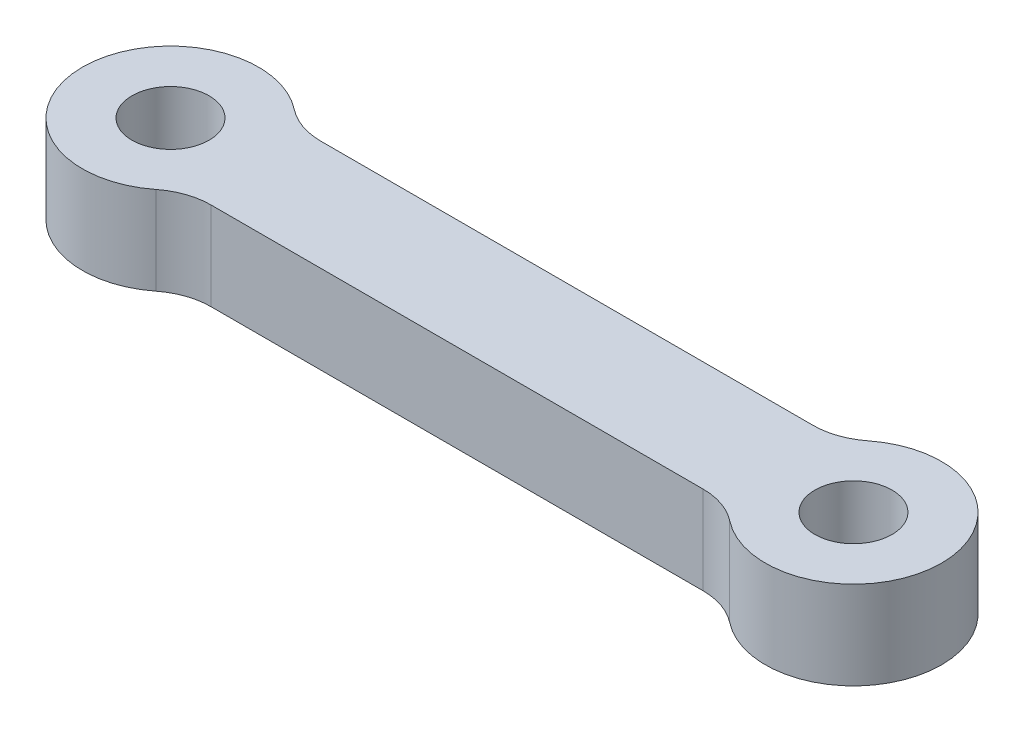
ISO-10303-21;
HEADER;
FILE_DESCRIPTION(('STEP AP214'),'2;1');
FILE_NAME('part.step','',(''),(''),'','','');
FILE_SCHEMA(('AUTOMOTIVE_DESIGN { 1 0 10303 214 1 1 1 1 }'));
ENDSEC;
DATA;
#1=APPLICATION_CONTEXT('core data for automotive mechanical design processes');
#2=APPLICATION_PROTOCOL_DEFINITION('international standard','automotive_design',2000,#1);
#3=PRODUCT_CONTEXT('',#1,'mechanical');
#4=PRODUCT('Part','Part','',(#3));
#5=PRODUCT_RELATED_PRODUCT_CATEGORY('part','',(#4));
#6=PRODUCT_DEFINITION_FORMATION('','',#4);
#7=PRODUCT_DEFINITION_CONTEXT('part definition',#1,'design');
#8=PRODUCT_DEFINITION('design','',#6,#7);
#9=PRODUCT_DEFINITION_SHAPE('','',#8);
#10=(LENGTH_UNIT() NAMED_UNIT(*) SI_UNIT(.MILLI.,.METRE.));
#11=(NAMED_UNIT(*) PLANE_ANGLE_UNIT() SI_UNIT($,.RADIAN.));
#12=(NAMED_UNIT(*) SI_UNIT($,.STERADIAN.) SOLID_ANGLE_UNIT());
#13=UNCERTAINTY_MEASURE_WITH_UNIT(LENGTH_MEASURE(1.E-05),#10,'distance_accuracy_value','');
#14=(GEOMETRIC_REPRESENTATION_CONTEXT(3) GLOBAL_UNCERTAINTY_ASSIGNED_CONTEXT((#13)) GLOBAL_UNIT_ASSIGNED_CONTEXT((#10,
#11,#12)) REPRESENTATION_CONTEXT('',''));
#15=CARTESIAN_POINT('',(0.,0.,0.));
#16=DIRECTION('',(0.,0.,1.));
#17=DIRECTION('',(1.,0.,0.));
#18=AXIS2_PLACEMENT_3D('',#15,#16,#17);
#19=CARTESIAN_POINT('',(31000.,4000.,0.));
#20=DIRECTION('',(0.,-1.,0.));
#21=DIRECTION('',(0.,0.,-1.));
#22=AXIS2_PLACEMENT_3D('',#19,#20,#21);
#23=CYLINDRICAL_SURFACE('',#22,4000.);
#24=CARTESIAN_POINT('',(31000.,0.,0.));
#25=DIRECTION('',(0.,1.,0.));
#26=DIRECTION('',(0.,0.,1.));
#27=AXIS2_PLACEMENT_3D('',#24,#25,#26);
#28=CIRCLE('',#27,4000.);
#29=CARTESIAN_POINT('',(28525.641703473,0.,3142.85714285714));
#30=VERTEX_POINT('',#29);
#31=CARTESIAN_POINT('',(28525.641703473,0.,-3142.85714285714));
#32=VERTEX_POINT('',#31);
#33=EDGE_CURVE('E146',#30,#32,#28,.T.);
#34=ORIENTED_EDGE('',*,*,#33,.T.);
#35=DIRECTION('',(0.,-1.,0.));
#36=VECTOR('',#35,1.);
#37=CARTESIAN_POINT('',(28525.641703473,4000.,-3142.85714285714));
#38=LINE('',#37,#36);
#39=CARTESIAN_POINT('',(28525.641703473,4000.,-3142.85714285714));
#40=VERTEX_POINT('',#39);
#41=EDGE_CURVE('E57',#32,#40,#38,.F.);
#42=ORIENTED_EDGE('',*,*,#41,.T.);
#43=CARTESIAN_POINT('',(31000.,4000.,0.));
#44=DIRECTION('',(0.,1.,0.));
#45=DIRECTION('',(0.,0.,1.));
#46=AXIS2_PLACEMENT_3D('',#43,#44,#45);
#47=CIRCLE('',#46,4000.);
#48=CARTESIAN_POINT('',(28525.641703473,4000.,3142.85714285714));
#49=VERTEX_POINT('',#48);
#50=EDGE_CURVE('E157',#49,#40,#47,.T.);
#51=ORIENTED_EDGE('',*,*,#50,.F.);
#52=DIRECTION('',(0.,-1.,0.));
#53=VECTOR('',#52,1.);
#54=CARTESIAN_POINT('',(28525.641703473,4000.,3142.85714285714));
#55=LINE('',#54,#53);
#56=EDGE_CURVE('E173',#49,#30,#55,.T.);
#57=ORIENTED_EDGE('',*,*,#56,.T.);
#58=EDGE_LOOP('',(#34,#42,#51,#57));
#59=FACE_BOUND('',#58,.T.);
#60=ADVANCED_FACE('F41',(#59),#23,.T.);
#61=CARTESIAN_POINT('',(0.,4000.,-2500.));
#62=DIRECTION('',(0.,0.,-1.));
#63=DIRECTION('',(-1.,0.,0.));
#64=AXIS2_PLACEMENT_3D('',#61,#62,#63);
#65=PLANE('',#64);
#66=DIRECTION('',(1.,0.,0.));
#67=VECTOR('',#66,1.);
#68=CARTESIAN_POINT('',(0.,0.,-2500.));
#69=LINE('',#68,#67);
#70=CARTESIAN_POINT('',(4330.12701892219,0.,-2500.));
#71=VERTEX_POINT('',#70);
#72=CARTESIAN_POINT('',(26669.8729810778,0.,-2500.));
#73=VERTEX_POINT('',#72);
#74=EDGE_CURVE('E139',#71,#73,#69,.T.);
#75=ORIENTED_EDGE('',*,*,#74,.F.);
#76=DIRECTION('',(0.,-1.,0.));
#77=VECTOR('',#76,1.);
#78=CARTESIAN_POINT('',(4330.12701892219,4000.,-2500.));
#79=LINE('',#78,#77);
#80=CARTESIAN_POINT('',(4330.12701892219,4000.,-2500.));
#81=VERTEX_POINT('',#80);
#82=EDGE_CURVE('E112',#71,#81,#79,.F.);
#83=ORIENTED_EDGE('',*,*,#82,.T.);
#84=DIRECTION('',(1.,0.,0.));
#85=VECTOR('',#84,1.);
#86=CARTESIAN_POINT('',(0.,4000.,-2500.));
#87=LINE('',#86,#85);
#88=CARTESIAN_POINT('',(26669.8729810778,4000.,-2500.));
#89=VERTEX_POINT('',#88);
#90=EDGE_CURVE('E201',#81,#89,#87,.T.);
#91=ORIENTED_EDGE('',*,*,#90,.T.);
#92=DIRECTION('',(0.,-1.,0.));
#93=VECTOR('',#92,1.);
#94=CARTESIAN_POINT('',(26669.8729810778,4000.,-2500.));
#95=LINE('',#94,#93);
#96=EDGE_CURVE('E129',#89,#73,#95,.T.);
#97=ORIENTED_EDGE('',*,*,#96,.T.);
#98=EDGE_LOOP('',(#75,#83,#91,#97));
#99=FACE_BOUND('',#98,.T.);
#100=ADVANCED_FACE('F235',(#99),#65,.T.);
#101=CARTESIAN_POINT('',(0.,4000.,0.));
#102=DIRECTION('',(0.,-1.,0.));
#103=DIRECTION('',(0.,0.,-1.));
#104=AXIS2_PLACEMENT_3D('',#101,#102,#103);
#105=CYLINDRICAL_SURFACE('',#104,4000.);
#106=CARTESIAN_POINT('',(0.,4000.,0.));
#107=DIRECTION('',(0.,1.,0.));
#108=DIRECTION('',(0.,0.,1.));
#109=AXIS2_PLACEMENT_3D('',#106,#107,#108);
#110=CIRCLE('',#109,4000.);
#111=CARTESIAN_POINT('',(2474.35829652697,4000.,-3142.85714285714));
#112=VERTEX_POINT('',#111);
#113=CARTESIAN_POINT('',(2474.35829652697,4000.,3142.85714285714));
#114=VERTEX_POINT('',#113);
#115=EDGE_CURVE('E127',#112,#114,#110,.T.);
#116=ORIENTED_EDGE('',*,*,#115,.F.);
#117=DIRECTION('',(0.,-1.,0.));
#118=VECTOR('',#117,1.);
#119=CARTESIAN_POINT('',(2474.35829652697,4000.,-3142.85714285714));
#120=LINE('',#119,#118);
#121=CARTESIAN_POINT('',(2474.35829652697,0.,-3142.85714285714));
#122=VERTEX_POINT('',#121);
#123=EDGE_CURVE('E111',#112,#122,#120,.T.);
#124=ORIENTED_EDGE('',*,*,#123,.T.);
#125=CARTESIAN_POINT('',(0.,0.,0.));
#126=DIRECTION('',(0.,1.,0.));
#127=DIRECTION('',(0.,0.,1.));
#128=AXIS2_PLACEMENT_3D('',#125,#126,#127);
#129=CIRCLE('',#128,4000.);
#130=CARTESIAN_POINT('',(2474.35829652697,0.,3142.85714285714));
#131=VERTEX_POINT('',#130);
#132=EDGE_CURVE('E124',#122,#131,#129,.T.);
#133=ORIENTED_EDGE('',*,*,#132,.T.);
#134=DIRECTION('',(0.,-1.,0.));
#135=VECTOR('',#134,1.);
#136=CARTESIAN_POINT('',(2474.35829652697,4000.,3142.85714285714));
#137=LINE('',#136,#135);
#138=EDGE_CURVE('E130',#131,#114,#137,.F.);
#139=ORIENTED_EDGE('',*,*,#138,.T.);
#140=EDGE_LOOP('',(#116,#124,#133,#139));
#141=FACE_BOUND('',#140,.T.);
#142=ADVANCED_FACE('F123',(#141),#105,.T.);
#143=CARTESIAN_POINT('',(0.,4000.,0.));
#144=DIRECTION('',(0.,-1.,0.));
#145=DIRECTION('',(0.,0.,-1.));
#146=AXIS2_PLACEMENT_3D('',#143,#144,#145);
#147=CYLINDRICAL_SURFACE('',#146,1750.);
#148=CARTESIAN_POINT('',(0.,4000.,0.));
#149=DIRECTION('',(0.,1.,0.));
#150=DIRECTION('',(0.,0.,1.));
#151=AXIS2_PLACEMENT_3D('',#148,#149,#150);
#152=CIRCLE('',#151,1750.);
#153=CARTESIAN_POINT('',(0.,4000.,1750.));
#154=VERTEX_POINT('',#153);
#155=EDGE_CURVE('E212',#154,#154,#152,.T.);
#156=ORIENTED_EDGE('',*,*,#155,.T.);
#157=EDGE_LOOP('',(#156));
#158=FACE_BOUND('',#157,.T.);
#159=CARTESIAN_POINT('',(0.,0.,0.));
#160=DIRECTION('',(0.,1.,0.));
#161=DIRECTION('',(0.,0.,1.));
#162=AXIS2_PLACEMENT_3D('',#159,#160,#161);
#163=CIRCLE('',#162,1750.);
#164=CARTESIAN_POINT('',(0.,0.,1750.));
#165=VERTEX_POINT('',#164);
#166=EDGE_CURVE('E144',#165,#165,#163,.T.);
#167=ORIENTED_EDGE('',*,*,#166,.F.);
#168=EDGE_LOOP('',(#167));
#169=FACE_BOUND('',#168,.T.);
#170=ADVANCED_FACE('F298',(#158,#169),#147,.F.);
#171=CARTESIAN_POINT('',(0.,4000.,2500.));
#172=DIRECTION('',(0.,0.,-1.));
#173=DIRECTION('',(-1.,0.,0.));
#174=AXIS2_PLACEMENT_3D('',#171,#172,#173);
#175=PLANE('',#174);
#176=DIRECTION('',(1.,0.,0.));
#177=VECTOR('',#176,1.);
#178=CARTESIAN_POINT('',(0.,4000.,2500.));
#179=LINE('',#178,#177);
#180=CARTESIAN_POINT('',(4330.12701892219,4000.,2500.));
#181=VERTEX_POINT('',#180);
#182=CARTESIAN_POINT('',(26669.8729810778,4000.,2500.));
#183=VERTEX_POINT('',#182);
#184=EDGE_CURVE('E209',#181,#183,#179,.T.);
#185=ORIENTED_EDGE('',*,*,#184,.F.);
#186=DIRECTION('',(0.,1.,0.));
#187=VECTOR('',#186,1.);
#188=CARTESIAN_POINT('',(4330.12701892219,0.,2500.));
#189=LINE('',#188,#187);
#190=CARTESIAN_POINT('',(4330.12701892219,0.,2500.));
#191=VERTEX_POINT('',#190);
#192=EDGE_CURVE('E169',#181,#191,#189,.F.);
#193=ORIENTED_EDGE('',*,*,#192,.T.);
#194=DIRECTION('',(1.,0.,0.));
#195=VECTOR('',#194,1.);
#196=CARTESIAN_POINT('',(0.,0.,2500.));
#197=LINE('',#196,#195);
#198=CARTESIAN_POINT('',(26669.8729810778,0.,2500.));
#199=VERTEX_POINT('',#198);
#200=EDGE_CURVE('E138',#191,#199,#197,.T.);
#201=ORIENTED_EDGE('',*,*,#200,.T.);
#202=DIRECTION('',(0.,1.,0.));
#203=VECTOR('',#202,1.);
#204=CARTESIAN_POINT('',(26669.8729810778,4000.,2500.));
#205=LINE('',#204,#203);
#206=EDGE_CURVE('E166',#199,#183,#205,.T.);
#207=ORIENTED_EDGE('',*,*,#206,.T.);
#208=EDGE_LOOP('',(#185,#193,#201,#207));
#209=FACE_BOUND('',#208,.T.);
#210=ADVANCED_FACE('F197',(#209),#175,.F.);
#211=CARTESIAN_POINT('',(31000.,4000.,0.));
#212=DIRECTION('',(0.,-1.,0.));
#213=DIRECTION('',(0.,0.,-1.));
#214=AXIS2_PLACEMENT_3D('',#211,#212,#213);
#215=CYLINDRICAL_SURFACE('',#214,1750.);
#216=CARTESIAN_POINT('',(31000.,4000.,0.));
#217=DIRECTION('',(0.,1.,0.));
#218=DIRECTION('',(0.,0.,1.));
#219=AXIS2_PLACEMENT_3D('',#216,#217,#218);
#220=CIRCLE('',#219,1750.);
#221=CARTESIAN_POINT('',(31000.,4000.,1750.));
#222=VERTEX_POINT('',#221);
#223=EDGE_CURVE('E159',#222,#222,#220,.T.);
#224=ORIENTED_EDGE('',*,*,#223,.T.);
#225=EDGE_LOOP('',(#224));
#226=FACE_BOUND('',#225,.T.);
#227=CARTESIAN_POINT('',(31000.,0.,0.));
#228=DIRECTION('',(0.,1.,0.));
#229=DIRECTION('',(0.,0.,1.));
#230=AXIS2_PLACEMENT_3D('',#227,#228,#229);
#231=CIRCLE('',#230,1750.);
#232=CARTESIAN_POINT('',(31000.,0.,1750.));
#233=VERTEX_POINT('',#232);
#234=EDGE_CURVE('E153',#233,#233,#231,.T.);
#235=ORIENTED_EDGE('',*,*,#234,.F.);
#236=EDGE_LOOP('',(#235));
#237=FACE_BOUND('',#236,.T.);
#238=ADVANCED_FACE('F221',(#226,#237),#215,.F.);
#239=CARTESIAN_POINT('',(0.,4000.,0.));
#240=DIRECTION('',(0.,1.,0.));
#241=DIRECTION('',(0.,0.,1.));
#242=AXIS2_PLACEMENT_3D('',#239,#240,#241);
#243=PLANE('',#242);
#244=ORIENTED_EDGE('',*,*,#184,.T.);
#245=CARTESIAN_POINT('',(26669.8729810778,4000.,5500.));
#246=DIRECTION('',(0.,1.,0.));
#247=DIRECTION('',(0.,0.,1.));
#248=AXIS2_PLACEMENT_3D('',#245,#246,#247);
#249=CIRCLE('',#248,3000.);
#250=EDGE_CURVE('E11',#183,#49,#249,.F.);
#251=ORIENTED_EDGE('',*,*,#250,.T.);
#252=ORIENTED_EDGE('',*,*,#50,.T.);
#253=CARTESIAN_POINT('',(26669.8729810778,4000.,-5500.));
#254=DIRECTION('',(0.,1.,0.));
#255=DIRECTION('',(0.,0.,1.));
#256=AXIS2_PLACEMENT_3D('',#253,#254,#255);
#257=CIRCLE('',#256,3000.);
#258=EDGE_CURVE('E189',#40,#89,#257,.F.);
#259=ORIENTED_EDGE('',*,*,#258,.T.);
#260=ORIENTED_EDGE('',*,*,#90,.F.);
#261=CARTESIAN_POINT('',(4330.12701892219,4000.,-5500.));
#262=DIRECTION('',(0.,1.,0.));
#263=DIRECTION('',(0.,0.,1.));
#264=AXIS2_PLACEMENT_3D('',#261,#262,#263);
#265=CIRCLE('',#264,3000.);
#266=EDGE_CURVE('E118',#81,#112,#265,.F.);
#267=ORIENTED_EDGE('',*,*,#266,.T.);
#268=ORIENTED_EDGE('',*,*,#115,.T.);
#269=CARTESIAN_POINT('',(4330.12701892219,4000.,5500.));
#270=DIRECTION('',(0.,1.,0.));
#271=DIRECTION('',(0.,0.,1.));
#272=AXIS2_PLACEMENT_3D('',#269,#270,#271);
#273=CIRCLE('',#272,3000.);
#274=EDGE_CURVE('E183',#114,#181,#273,.F.);
#275=ORIENTED_EDGE('',*,*,#274,.T.);
#276=EDGE_LOOP('',(#244,#251,#252,#259,#260,#267,#268,#275));
#277=FACE_BOUND('',#276,.T.);
#278=ORIENTED_EDGE('',*,*,#155,.F.);
#279=EDGE_LOOP('',(#278));
#280=FACE_BOUND('',#279,.T.);
#281=ORIENTED_EDGE('',*,*,#223,.F.);
#282=EDGE_LOOP('',(#281));
#283=FACE_BOUND('',#282,.T.);
#284=ADVANCED_FACE('F224',(#277,#280,#283),#243,.T.);
#285=CARTESIAN_POINT('',(0.,0.,0.));
#286=DIRECTION('',(0.,1.,0.));
#287=DIRECTION('',(0.,0.,1.));
#288=AXIS2_PLACEMENT_3D('',#285,#286,#287);
#289=PLANE('',#288);
#290=ORIENTED_EDGE('',*,*,#33,.F.);
#291=CARTESIAN_POINT('',(26669.8729810778,0.,5500.));
#292=DIRECTION('',(0.,1.,0.));
#293=DIRECTION('',(0.,0.,1.));
#294=AXIS2_PLACEMENT_3D('',#291,#292,#293);
#295=CIRCLE('',#294,3000.);
#296=EDGE_CURVE('E50',#30,#199,#295,.T.);
#297=ORIENTED_EDGE('',*,*,#296,.T.);
#298=ORIENTED_EDGE('',*,*,#200,.F.);
#299=CARTESIAN_POINT('',(4330.12701892219,0.,5500.));
#300=DIRECTION('',(0.,1.,0.));
#301=DIRECTION('',(0.,0.,1.));
#302=AXIS2_PLACEMENT_3D('',#299,#300,#301);
#303=CIRCLE('',#302,3000.);
#304=EDGE_CURVE('E136',#191,#131,#303,.T.);
#305=ORIENTED_EDGE('',*,*,#304,.T.);
#306=ORIENTED_EDGE('',*,*,#132,.F.);
#307=CARTESIAN_POINT('',(4330.12701892219,0.,-5500.));
#308=DIRECTION('',(0.,1.,0.));
#309=DIRECTION('',(0.,0.,1.));
#310=AXIS2_PLACEMENT_3D('',#307,#308,#309);
#311=CIRCLE('',#310,3000.);
#312=EDGE_CURVE('E107',#122,#71,#311,.T.);
#313=ORIENTED_EDGE('',*,*,#312,.T.);
#314=ORIENTED_EDGE('',*,*,#74,.T.);
#315=CARTESIAN_POINT('',(26669.8729810778,0.,-5500.));
#316=DIRECTION('',(0.,1.,0.));
#317=DIRECTION('',(0.,0.,1.));
#318=AXIS2_PLACEMENT_3D('',#315,#316,#317);
#319=CIRCLE('',#318,3000.);
#320=EDGE_CURVE('E186',#73,#32,#319,.T.);
#321=ORIENTED_EDGE('',*,*,#320,.T.);
#322=EDGE_LOOP('',(#290,#297,#298,#305,#306,#313,#314,#321));
#323=FACE_BOUND('',#322,.T.);
#324=ORIENTED_EDGE('',*,*,#166,.T.);
#325=EDGE_LOOP('',(#324));
#326=FACE_BOUND('',#325,.T.);
#327=ORIENTED_EDGE('',*,*,#234,.T.);
#328=EDGE_LOOP('',(#327));
#329=FACE_BOUND('',#328,.T.);
#330=ADVANCED_FACE('F133',(#323,#326,#329),#289,.F.);
#331=CARTESIAN_POINT('',(4330.12701892219,4000.,-5500.));
#332=DIRECTION('',(0.,-1.,0.));
#333=DIRECTION('',(0.,0.,-1.));
#334=AXIS2_PLACEMENT_3D('',#331,#332,#333);
#335=CYLINDRICAL_SURFACE('',#334,3000.);
#336=ORIENTED_EDGE('',*,*,#266,.F.);
#337=ORIENTED_EDGE('',*,*,#82,.F.);
#338=ORIENTED_EDGE('',*,*,#312,.F.);
#339=ORIENTED_EDGE('',*,*,#123,.F.);
#340=EDGE_LOOP('',(#336,#337,#338,#339));
#341=FACE_BOUND('',#340,.T.);
#342=ADVANCED_FACE('F110',(#341),#335,.F.);
#343=CARTESIAN_POINT('',(4330.12701892219,4000.,5500.));
#344=DIRECTION('',(0.,-1.,0.));
#345=DIRECTION('',(0.,0.,-1.));
#346=AXIS2_PLACEMENT_3D('',#343,#344,#345);
#347=CYLINDRICAL_SURFACE('',#346,3000.);
#348=ORIENTED_EDGE('',*,*,#274,.F.);
#349=ORIENTED_EDGE('',*,*,#138,.F.);
#350=ORIENTED_EDGE('',*,*,#304,.F.);
#351=ORIENTED_EDGE('',*,*,#192,.F.);
#352=EDGE_LOOP('',(#348,#349,#350,#351));
#353=FACE_BOUND('',#352,.T.);
#354=ADVANCED_FACE('F246',(#353),#347,.F.);
#355=CARTESIAN_POINT('',(26669.8729810778,4000.,-5500.));
#356=DIRECTION('',(0.,-1.,0.));
#357=DIRECTION('',(0.,0.,-1.));
#358=AXIS2_PLACEMENT_3D('',#355,#356,#357);
#359=CYLINDRICAL_SURFACE('',#358,3000.);
#360=ORIENTED_EDGE('',*,*,#258,.F.);
#361=ORIENTED_EDGE('',*,*,#41,.F.);
#362=ORIENTED_EDGE('',*,*,#320,.F.);
#363=ORIENTED_EDGE('',*,*,#96,.F.);
#364=EDGE_LOOP('',(#360,#361,#362,#363));
#365=FACE_BOUND('',#364,.T.);
#366=ADVANCED_FACE('F248',(#365),#359,.F.);
#367=CARTESIAN_POINT('',(26669.8729810778,4000.,5500.));
#368=DIRECTION('',(0.,-1.,0.));
#369=DIRECTION('',(0.,0.,-1.));
#370=AXIS2_PLACEMENT_3D('',#367,#368,#369);
#371=CYLINDRICAL_SURFACE('',#370,3000.);
#372=ORIENTED_EDGE('',*,*,#250,.F.);
#373=ORIENTED_EDGE('',*,*,#206,.F.);
#374=ORIENTED_EDGE('',*,*,#296,.F.);
#375=ORIENTED_EDGE('',*,*,#56,.F.);
#376=EDGE_LOOP('',(#372,#373,#374,#375));
#377=FACE_BOUND('',#376,.T.);
#378=ADVANCED_FACE('F43',(#377),#371,.F.);
#379=CLOSED_SHELL('',(#60,#100,#142,#170,#210,#238,#284,#330,#342,#354,#366,#378));
#380=MANIFOLD_SOLID_BREP('B2',#379);
#381=ADVANCED_BREP_SHAPE_REPRESENTATION('',(#18,#380),#14);
#382=SHAPE_DEFINITION_REPRESENTATION(#9,#381);
ENDSEC;
END-ISO-10303-21;
